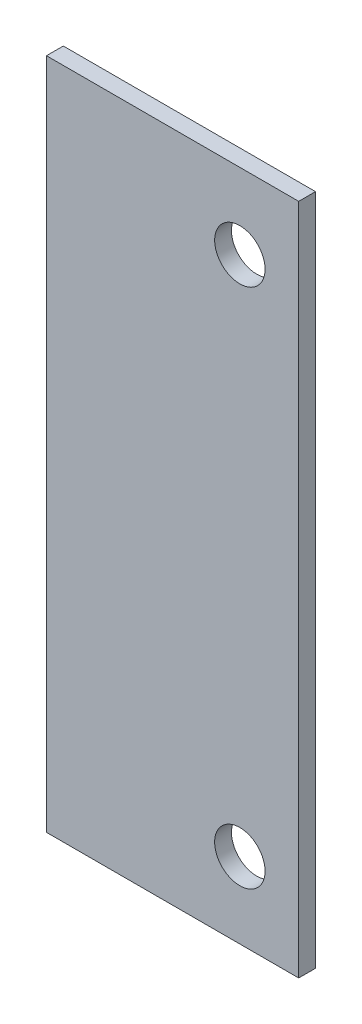
ISO-10303-21;
HEADER;
FILE_DESCRIPTION(('STEP AP214'),'2;1');
FILE_NAME('part.step','',(''),(''),'','','');
FILE_SCHEMA(('AUTOMOTIVE_DESIGN { 1 0 10303 214 1 1 1 1 }'));
ENDSEC;
DATA;
#1=APPLICATION_CONTEXT('core data for automotive mechanical design processes');
#2=APPLICATION_PROTOCOL_DEFINITION('international standard','automotive_design',2000,#1);
#3=PRODUCT_CONTEXT('',#1,'mechanical');
#4=PRODUCT('Part','Part','',(#3));
#5=PRODUCT_RELATED_PRODUCT_CATEGORY('part','',(#4));
#6=PRODUCT_DEFINITION_FORMATION('','',#4);
#7=PRODUCT_DEFINITION_CONTEXT('part definition',#1,'design');
#8=PRODUCT_DEFINITION('design','',#6,#7);
#9=PRODUCT_DEFINITION_SHAPE('','',#8);
#10=(LENGTH_UNIT() NAMED_UNIT(*) SI_UNIT(.MILLI.,.METRE.));
#11=(NAMED_UNIT(*) PLANE_ANGLE_UNIT() SI_UNIT($,.RADIAN.));
#12=(NAMED_UNIT(*) SI_UNIT($,.STERADIAN.) SOLID_ANGLE_UNIT());
#13=UNCERTAINTY_MEASURE_WITH_UNIT(LENGTH_MEASURE(1.E-05),#10,'distance_accuracy_value','');
#14=(GEOMETRIC_REPRESENTATION_CONTEXT(3) GLOBAL_UNCERTAINTY_ASSIGNED_CONTEXT((#13)) GLOBAL_UNIT_ASSIGNED_CONTEXT((#10,
#11,#12)) REPRESENTATION_CONTEXT('',''));
#15=CARTESIAN_POINT('',(0.,0.,0.));
#16=DIRECTION('',(0.,0.,1.));
#17=DIRECTION('',(1.,0.,0.));
#18=AXIS2_PLACEMENT_3D('',#15,#16,#17);
#19=CARTESIAN_POINT('',(-9.99999999999999,-40.,2.));
#20=DIRECTION('',(0.,1.,0.));
#21=DIRECTION('',(-1.,0.,0.));
#22=AXIS2_PLACEMENT_3D('',#19,#20,#21);
#23=PLANE('',#22);
#24=DIRECTION('',(1.,0.,0.));
#25=VECTOR('',#24,1.);
#26=CARTESIAN_POINT('',(-9.99999999999999,-40.,0.));
#27=LINE('',#26,#25);
#28=CARTESIAN_POINT('',(-9.99999999999999,-40.,0.));
#29=VERTEX_POINT('',#28);
#30=CARTESIAN_POINT('',(20.,-40.,0.));
#31=VERTEX_POINT('',#30);
#32=EDGE_CURVE('E101',#29,#31,#27,.T.);
#33=ORIENTED_EDGE('',*,*,#32,.T.);
#34=DIRECTION('',(0.,0.,-1.));
#35=VECTOR('',#34,1.);
#36=CARTESIAN_POINT('',(20.,-40.,2.));
#37=LINE('',#36,#35);
#38=CARTESIAN_POINT('',(20.,-40.,2.));
#39=VERTEX_POINT('',#38);
#40=EDGE_CURVE('E11',#39,#31,#37,.T.);
#41=ORIENTED_EDGE('',*,*,#40,.F.);
#42=DIRECTION('',(1.,0.,0.));
#43=VECTOR('',#42,1.);
#44=CARTESIAN_POINT('',(-9.99999999999999,-40.,2.));
#45=LINE('',#44,#43);
#46=CARTESIAN_POINT('',(-9.99999999999999,-40.,2.));
#47=VERTEX_POINT('',#46);
#48=EDGE_CURVE('E88',#47,#39,#45,.T.);
#49=ORIENTED_EDGE('',*,*,#48,.F.);
#50=DIRECTION('',(0.,0.,-1.));
#51=VECTOR('',#50,1.);
#52=CARTESIAN_POINT('',(-9.99999999999999,-40.,2.));
#53=LINE('',#52,#51);
#54=EDGE_CURVE('E97',#47,#29,#53,.T.);
#55=ORIENTED_EDGE('',*,*,#54,.T.);
#56=EDGE_LOOP('',(#33,#41,#49,#55));
#57=FACE_BOUND('',#56,.T.);
#58=ADVANCED_FACE('F35',(#57),#23,.F.);
#59=CARTESIAN_POINT('',(19.9999999999999,40.,2.));
#60=DIRECTION('',(-1.,0.,0.));
#61=DIRECTION('',(0.,-1.,0.));
#62=AXIS2_PLACEMENT_3D('',#59,#60,#61);
#63=PLANE('',#62);
#64=DIRECTION('',(0.,1.,0.));
#65=VECTOR('',#64,1.);
#66=CARTESIAN_POINT('',(19.9999999999999,40.,0.));
#67=LINE('',#66,#65);
#68=CARTESIAN_POINT('',(19.9999999999999,40.,0.));
#69=VERTEX_POINT('',#68);
#70=EDGE_CURVE('E92',#31,#69,#67,.T.);
#71=ORIENTED_EDGE('',*,*,#70,.T.);
#72=DIRECTION('',(0.,0.,-1.));
#73=VECTOR('',#72,1.);
#74=CARTESIAN_POINT('',(19.9999999999999,40.,2.));
#75=LINE('',#74,#73);
#76=CARTESIAN_POINT('',(19.9999999999999,40.,2.));
#77=VERTEX_POINT('',#76);
#78=EDGE_CURVE('E44',#77,#69,#75,.T.);
#79=ORIENTED_EDGE('',*,*,#78,.F.);
#80=DIRECTION('',(0.,1.,0.));
#81=VECTOR('',#80,1.);
#82=CARTESIAN_POINT('',(19.9999999999999,40.,2.));
#83=LINE('',#82,#81);
#84=EDGE_CURVE('E83',#39,#77,#83,.T.);
#85=ORIENTED_EDGE('',*,*,#84,.F.);
#86=ORIENTED_EDGE('',*,*,#40,.T.);
#87=EDGE_LOOP('',(#71,#79,#85,#86));
#88=FACE_BOUND('',#87,.T.);
#89=ADVANCED_FACE('F91',(#88),#63,.F.);
#90=CARTESIAN_POINT('',(-9.99999999999996,40.,2.));
#91=DIRECTION('',(0.,-1.,0.));
#92=DIRECTION('',(1.,0.,0.));
#93=AXIS2_PLACEMENT_3D('',#90,#91,#92);
#94=PLANE('',#93);
#95=DIRECTION('',(-1.,0.,0.));
#96=VECTOR('',#95,1.);
#97=CARTESIAN_POINT('',(-9.99999999999996,40.,0.));
#98=LINE('',#97,#96);
#99=CARTESIAN_POINT('',(-9.99999999999996,40.,0.));
#100=VERTEX_POINT('',#99);
#101=EDGE_CURVE('E70',#69,#100,#98,.T.);
#102=ORIENTED_EDGE('',*,*,#101,.T.);
#103=DIRECTION('',(0.,0.,-1.));
#104=VECTOR('',#103,1.);
#105=CARTESIAN_POINT('',(-9.99999999999996,40.,2.));
#106=LINE('',#105,#104);
#107=CARTESIAN_POINT('',(-9.99999999999996,40.,2.));
#108=VERTEX_POINT('',#107);
#109=EDGE_CURVE('E93',#108,#100,#106,.T.);
#110=ORIENTED_EDGE('',*,*,#109,.F.);
#111=DIRECTION('',(-1.,0.,0.));
#112=VECTOR('',#111,1.);
#113=CARTESIAN_POINT('',(-9.99999999999996,40.,2.));
#114=LINE('',#113,#112);
#115=EDGE_CURVE('E86',#77,#108,#114,.T.);
#116=ORIENTED_EDGE('',*,*,#115,.F.);
#117=ORIENTED_EDGE('',*,*,#78,.T.);
#118=EDGE_LOOP('',(#102,#110,#116,#117));
#119=FACE_BOUND('',#118,.T.);
#120=ADVANCED_FACE('F95',(#119),#94,.F.);
#121=CARTESIAN_POINT('',(-9.99999999999996,40.,2.));
#122=DIRECTION('',(1.,0.,0.));
#123=DIRECTION('',(0.,1.,0.));
#124=AXIS2_PLACEMENT_3D('',#121,#122,#123);
#125=PLANE('',#124);
#126=DIRECTION('',(0.,-1.,0.));
#127=VECTOR('',#126,1.);
#128=CARTESIAN_POINT('',(-9.99999999999996,40.,0.));
#129=LINE('',#128,#127);
#130=EDGE_CURVE('E76',#100,#29,#129,.T.);
#131=ORIENTED_EDGE('',*,*,#130,.T.);
#132=ORIENTED_EDGE('',*,*,#54,.F.);
#133=DIRECTION('',(0.,-1.,0.));
#134=VECTOR('',#133,1.);
#135=CARTESIAN_POINT('',(-9.99999999999996,40.,2.));
#136=LINE('',#135,#134);
#137=EDGE_CURVE('E53',#108,#47,#136,.T.);
#138=ORIENTED_EDGE('',*,*,#137,.F.);
#139=ORIENTED_EDGE('',*,*,#109,.T.);
#140=EDGE_LOOP('',(#131,#132,#138,#139));
#141=FACE_BOUND('',#140,.T.);
#142=ADVANCED_FACE('F127',(#141),#125,.F.);
#143=CARTESIAN_POINT('',(0.,0.,2.));
#144=DIRECTION('',(0.,0.,-1.));
#145=DIRECTION('',(-1.,0.,0.));
#146=AXIS2_PLACEMENT_3D('',#143,#144,#145);
#147=PLANE('',#146);
#148=CARTESIAN_POINT('',(13.0000000000002,31.,2.));
#149=DIRECTION('',(0.,0.,1.));
#150=DIRECTION('',(1.,0.,0.));
#151=AXIS2_PLACEMENT_3D('',#148,#149,#150);
#152=CIRCLE('',#151,2.99999999999998);
#153=CARTESIAN_POINT('',(16.0000000000001,31.,2.));
#154=VERTEX_POINT('',#153);
#155=EDGE_CURVE('E110',#154,#154,#152,.T.);
#156=ORIENTED_EDGE('',*,*,#155,.F.);
#157=EDGE_LOOP('',(#156));
#158=FACE_BOUND('',#157,.T.);
#159=CARTESIAN_POINT('',(13.0000000000001,-31.,2.));
#160=DIRECTION('',(0.,0.,1.));
#161=DIRECTION('',(1.,0.,0.));
#162=AXIS2_PLACEMENT_3D('',#159,#160,#161);
#163=CIRCLE('',#162,2.99999999999998);
#164=CARTESIAN_POINT('',(16.0000000000001,-31.,2.));
#165=VERTEX_POINT('',#164);
#166=EDGE_CURVE('E115',#165,#165,#163,.T.);
#167=ORIENTED_EDGE('',*,*,#166,.F.);
#168=EDGE_LOOP('',(#167));
#169=FACE_BOUND('',#168,.T.);
#170=ORIENTED_EDGE('',*,*,#48,.T.);
#171=ORIENTED_EDGE('',*,*,#84,.T.);
#172=ORIENTED_EDGE('',*,*,#115,.T.);
#173=ORIENTED_EDGE('',*,*,#137,.T.);
#174=EDGE_LOOP('',(#170,#171,#172,#173));
#175=FACE_BOUND('',#174,.T.);
#176=ADVANCED_FACE('F84',(#158,#169,#175),#147,.F.);
#177=CARTESIAN_POINT('',(0.,0.,0.));
#178=DIRECTION('',(0.,0.,-1.));
#179=DIRECTION('',(-1.,0.,0.));
#180=AXIS2_PLACEMENT_3D('',#177,#178,#179);
#181=PLANE('',#180);
#182=CARTESIAN_POINT('',(13.0000000000002,31.,0.));
#183=DIRECTION('',(0.,0.,-1.));
#184=DIRECTION('',(-1.,0.,0.));
#185=AXIS2_PLACEMENT_3D('',#182,#183,#184);
#186=CIRCLE('',#185,2.99999999999998);
#187=CARTESIAN_POINT('',(10.0000000000002,31.,0.));
#188=VERTEX_POINT('',#187);
#189=EDGE_CURVE('E38',#188,#188,#186,.T.);
#190=ORIENTED_EDGE('',*,*,#189,.F.);
#191=EDGE_LOOP('',(#190));
#192=FACE_BOUND('',#191,.T.);
#193=CARTESIAN_POINT('',(13.0000000000001,-31.,0.));
#194=DIRECTION('',(0.,0.,-1.));
#195=DIRECTION('',(-1.,0.,0.));
#196=AXIS2_PLACEMENT_3D('',#193,#194,#195);
#197=CIRCLE('',#196,2.99999999999998);
#198=CARTESIAN_POINT('',(10.0000000000002,-31.,0.));
#199=VERTEX_POINT('',#198);
#200=EDGE_CURVE('E108',#199,#199,#197,.T.);
#201=ORIENTED_EDGE('',*,*,#200,.F.);
#202=EDGE_LOOP('',(#201));
#203=FACE_BOUND('',#202,.T.);
#204=ORIENTED_EDGE('',*,*,#32,.F.);
#205=ORIENTED_EDGE('',*,*,#130,.F.);
#206=ORIENTED_EDGE('',*,*,#101,.F.);
#207=ORIENTED_EDGE('',*,*,#70,.F.);
#208=EDGE_LOOP('',(#204,#205,#206,#207));
#209=FACE_BOUND('',#208,.T.);
#210=ADVANCED_FACE('F126',(#192,#203,#209),#181,.T.);
#211=CARTESIAN_POINT('',(13.0000000000001,-31.,-8.));
#212=DIRECTION('',(0.,0.,1.));
#213=DIRECTION('',(1.,0.,0.));
#214=AXIS2_PLACEMENT_3D('',#211,#212,#213);
#215=CYLINDRICAL_SURFACE('',#214,2.99999999999998);
#216=ORIENTED_EDGE('',*,*,#200,.T.);
#217=EDGE_LOOP('',(#216));
#218=FACE_BOUND('',#217,.T.);
#219=ORIENTED_EDGE('',*,*,#166,.T.);
#220=EDGE_LOOP('',(#219));
#221=FACE_BOUND('',#220,.T.);
#222=ADVANCED_FACE('F123',(#218,#221),#215,.F.);
#223=CARTESIAN_POINT('',(13.0000000000002,31.,-8.));
#224=DIRECTION('',(0.,0.,1.));
#225=DIRECTION('',(1.,0.,0.));
#226=AXIS2_PLACEMENT_3D('',#223,#224,#225);
#227=CYLINDRICAL_SURFACE('',#226,2.99999999999998);
#228=ORIENTED_EDGE('',*,*,#189,.T.);
#229=EDGE_LOOP('',(#228));
#230=FACE_BOUND('',#229,.T.);
#231=ORIENTED_EDGE('',*,*,#155,.T.);
#232=EDGE_LOOP('',(#231));
#233=FACE_BOUND('',#232,.T.);
#234=ADVANCED_FACE('F174',(#230,#233),#227,.F.);
#235=CLOSED_SHELL('',(#58,#89,#120,#142,#176,#210,#222,#234));
#236=MANIFOLD_SOLID_BREP('B2',#235);
#237=ADVANCED_BREP_SHAPE_REPRESENTATION('',(#18,#236),#14);
#238=SHAPE_DEFINITION_REPRESENTATION(#9,#237);
ENDSEC;
END-ISO-10303-21;
